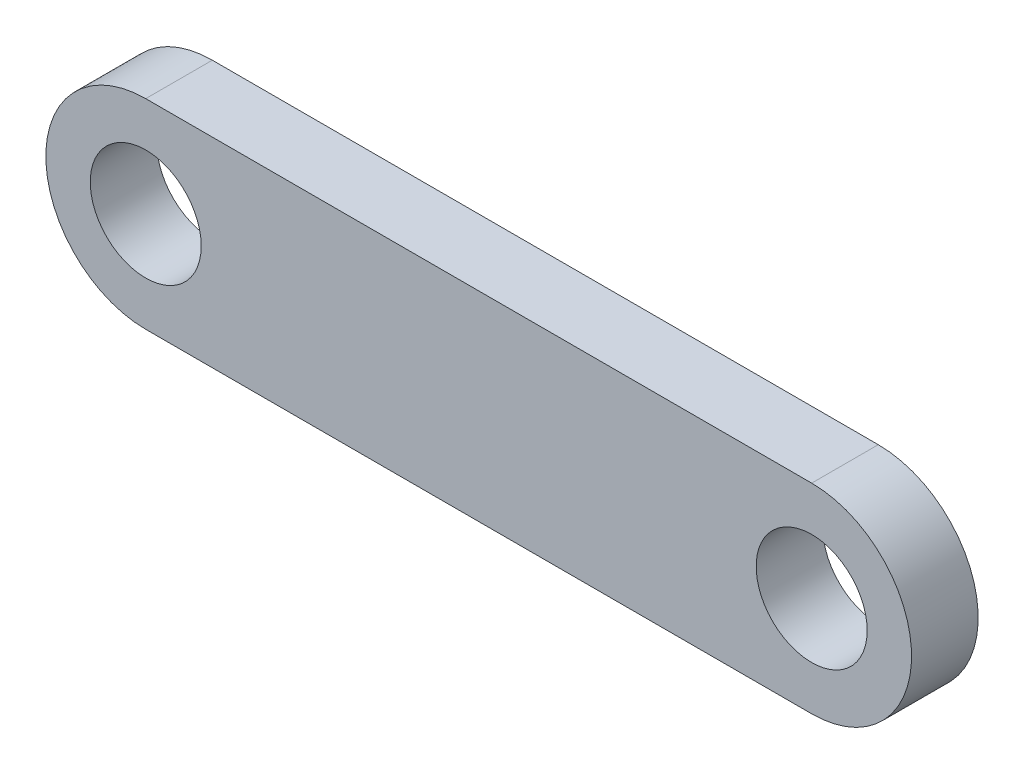
ISO-10303-21;
HEADER;
FILE_DESCRIPTION(('STEP AP214'),'2;1');
FILE_NAME('part.step','',(''),(''),'','','');
FILE_SCHEMA(('AUTOMOTIVE_DESIGN { 1 0 10303 214 1 1 1 1 }'));
ENDSEC;
DATA;
#1=APPLICATION_CONTEXT('core data for automotive mechanical design processes');
#2=APPLICATION_PROTOCOL_DEFINITION('international standard','automotive_design',2000,#1);
#3=PRODUCT_CONTEXT('',#1,'mechanical');
#4=PRODUCT('Part','Part','',(#3));
#5=PRODUCT_RELATED_PRODUCT_CATEGORY('part','',(#4));
#6=PRODUCT_DEFINITION_FORMATION('','',#4);
#7=PRODUCT_DEFINITION_CONTEXT('part definition',#1,'design');
#8=PRODUCT_DEFINITION('design','',#6,#7);
#9=PRODUCT_DEFINITION_SHAPE('','',#8);
#10=(LENGTH_UNIT() NAMED_UNIT(*) SI_UNIT(.MILLI.,.METRE.));
#11=(NAMED_UNIT(*) PLANE_ANGLE_UNIT() SI_UNIT($,.RADIAN.));
#12=(NAMED_UNIT(*) SI_UNIT($,.STERADIAN.) SOLID_ANGLE_UNIT());
#13=UNCERTAINTY_MEASURE_WITH_UNIT(LENGTH_MEASURE(1.E-05),#10,'distance_accuracy_value','');
#14=(GEOMETRIC_REPRESENTATION_CONTEXT(3) GLOBAL_UNCERTAINTY_ASSIGNED_CONTEXT((#13)) GLOBAL_UNIT_ASSIGNED_CONTEXT((#10,
#11,#12)) REPRESENTATION_CONTEXT('',''));
#15=CARTESIAN_POINT('',(0.,0.,0.));
#16=DIRECTION('',(0.,0.,1.));
#17=DIRECTION('',(1.,0.,0.));
#18=AXIS2_PLACEMENT_3D('',#15,#16,#17);
#19=CARTESIAN_POINT('',(-22.6794574039721,0.,6.));
#20=DIRECTION('',(0.,0.,1.));
#21=DIRECTION('',(1.,0.,0.));
#22=AXIS2_PLACEMENT_3D('',#19,#20,#21);
#23=PLANE('',#22);
#24=CARTESIAN_POINT('',(-22.6794574039721,0.,6.));
#25=DIRECTION('',(0.,0.,1.));
#26=DIRECTION('',(1.,0.,0.));
#27=AXIS2_PLACEMENT_3D('',#24,#25,#26);
#28=CIRCLE('',#27,5.);
#29=CARTESIAN_POINT('',(-17.6794574039721,0.,6.));
#30=VERTEX_POINT('',#29);
#31=EDGE_CURVE('E100',#30,#30,#28,.T.);
#32=ORIENTED_EDGE('',*,*,#31,.F.);
#33=EDGE_LOOP('',(#32));
#34=FACE_BOUND('',#33,.T.);
#35=CARTESIAN_POINT('',(-22.6794574039721,0.,6.));
#36=DIRECTION('',(0.,0.,1.));
#37=DIRECTION('',(1.,0.,0.));
#38=AXIS2_PLACEMENT_3D('',#35,#36,#37);
#39=CIRCLE('',#38,9.);
#40=CARTESIAN_POINT('',(-22.6794574039721,9.,6.));
#41=VERTEX_POINT('',#40);
#42=CARTESIAN_POINT('',(-22.6794574039721,-9.,6.));
#43=VERTEX_POINT('',#42);
#44=EDGE_CURVE('E85',#41,#43,#39,.T.);
#45=ORIENTED_EDGE('',*,*,#44,.T.);
#46=DIRECTION('',(1.,0.,0.));
#47=VECTOR('',#46,1.);
#48=CARTESIAN_POINT('',(-22.6794574039721,-9.,6.));
#49=LINE('',#48,#47);
#50=CARTESIAN_POINT('',(37.3205425960279,-9.,6.));
#51=VERTEX_POINT('',#50);
#52=EDGE_CURVE('E80',#43,#51,#49,.T.);
#53=ORIENTED_EDGE('',*,*,#52,.T.);
#54=CARTESIAN_POINT('',(37.3205425960279,0.,6.));
#55=DIRECTION('',(0.,0.,1.));
#56=DIRECTION('',(1.,0.,0.));
#57=AXIS2_PLACEMENT_3D('',#54,#55,#56);
#58=CIRCLE('',#57,9.);
#59=CARTESIAN_POINT('',(37.3205425960279,9.,6.));
#60=VERTEX_POINT('',#59);
#61=EDGE_CURVE('E83',#51,#60,#58,.T.);
#62=ORIENTED_EDGE('',*,*,#61,.T.);
#63=DIRECTION('',(-1.,0.,0.));
#64=VECTOR('',#63,1.);
#65=CARTESIAN_POINT('',(-22.6794574039721,9.,6.));
#66=LINE('',#65,#64);
#67=EDGE_CURVE('E50',#60,#41,#66,.T.);
#68=ORIENTED_EDGE('',*,*,#67,.T.);
#69=EDGE_LOOP('',(#45,#53,#62,#68));
#70=FACE_BOUND('',#69,.T.);
#71=CARTESIAN_POINT('',(37.3205425960279,0.,6.));
#72=DIRECTION('',(0.,0.,1.));
#73=DIRECTION('',(1.,0.,0.));
#74=AXIS2_PLACEMENT_3D('',#71,#72,#73);
#75=CIRCLE('',#74,5.);
#76=CARTESIAN_POINT('',(42.3205425960279,0.,6.));
#77=VERTEX_POINT('',#76);
#78=EDGE_CURVE('E115',#77,#77,#75,.T.);
#79=ORIENTED_EDGE('',*,*,#78,.F.);
#80=EDGE_LOOP('',(#79));
#81=FACE_BOUND('',#80,.T.);
#82=ADVANCED_FACE('F33',(#34,#70,#81),#23,.T.);
#83=CARTESIAN_POINT('',(-22.6794574039721,0.,0.));
#84=DIRECTION('',(0.,0.,1.));
#85=DIRECTION('',(1.,0.,0.));
#86=AXIS2_PLACEMENT_3D('',#83,#84,#85);
#87=PLANE('',#86);
#88=CARTESIAN_POINT('',(-22.6794574039721,0.,0.));
#89=DIRECTION('',(0.,0.,1.));
#90=DIRECTION('',(1.,0.,0.));
#91=AXIS2_PLACEMENT_3D('',#88,#89,#90);
#92=CIRCLE('',#91,9.);
#93=CARTESIAN_POINT('',(-22.6794574039721,9.,0.));
#94=VERTEX_POINT('',#93);
#95=CARTESIAN_POINT('',(-22.6794574039721,-9.,0.));
#96=VERTEX_POINT('',#95);
#97=EDGE_CURVE('E97',#94,#96,#92,.T.);
#98=ORIENTED_EDGE('',*,*,#97,.F.);
#99=DIRECTION('',(-1.,0.,0.));
#100=VECTOR('',#99,1.);
#101=CARTESIAN_POINT('',(-22.6794574039721,9.,0.));
#102=LINE('',#101,#100);
#103=CARTESIAN_POINT('',(37.3205425960279,9.,0.));
#104=VERTEX_POINT('',#103);
#105=EDGE_CURVE('E73',#104,#94,#102,.T.);
#106=ORIENTED_EDGE('',*,*,#105,.F.);
#107=CARTESIAN_POINT('',(37.3205425960279,0.,0.));
#108=DIRECTION('',(0.,0.,1.));
#109=DIRECTION('',(1.,0.,0.));
#110=AXIS2_PLACEMENT_3D('',#107,#108,#109);
#111=CIRCLE('',#110,9.);
#112=CARTESIAN_POINT('',(37.3205425960279,-9.,0.));
#113=VERTEX_POINT('',#112);
#114=EDGE_CURVE('E67',#113,#104,#111,.T.);
#115=ORIENTED_EDGE('',*,*,#114,.F.);
#116=DIRECTION('',(1.,0.,0.));
#117=VECTOR('',#116,1.);
#118=CARTESIAN_POINT('',(-22.6794574039721,-9.,0.));
#119=LINE('',#118,#117);
#120=EDGE_CURVE('E89',#96,#113,#119,.T.);
#121=ORIENTED_EDGE('',*,*,#120,.F.);
#122=EDGE_LOOP('',(#98,#106,#115,#121));
#123=FACE_BOUND('',#122,.T.);
#124=CARTESIAN_POINT('',(-22.6794574039721,0.,0.));
#125=DIRECTION('',(0.,0.,1.));
#126=DIRECTION('',(1.,0.,0.));
#127=AXIS2_PLACEMENT_3D('',#124,#125,#126);
#128=CIRCLE('',#127,5.);
#129=CARTESIAN_POINT('',(-17.6794574039721,0.,0.));
#130=VERTEX_POINT('',#129);
#131=EDGE_CURVE('E112',#130,#130,#128,.T.);
#132=ORIENTED_EDGE('',*,*,#131,.T.);
#133=EDGE_LOOP('',(#132));
#134=FACE_BOUND('',#133,.T.);
#135=CARTESIAN_POINT('',(37.3205425960279,0.,0.));
#136=DIRECTION('',(0.,0.,1.));
#137=DIRECTION('',(1.,0.,0.));
#138=AXIS2_PLACEMENT_3D('',#135,#136,#137);
#139=CIRCLE('',#138,5.);
#140=CARTESIAN_POINT('',(42.3205425960279,0.,0.));
#141=VERTEX_POINT('',#140);
#142=EDGE_CURVE('E118',#141,#141,#139,.T.);
#143=ORIENTED_EDGE('',*,*,#142,.T.);
#144=EDGE_LOOP('',(#143));
#145=FACE_BOUND('',#144,.T.);
#146=ADVANCED_FACE('F108',(#123,#134,#145),#87,.F.);
#147=CARTESIAN_POINT('',(-22.6794574039721,0.,6.));
#148=DIRECTION('',(0.,0.,-1.));
#149=DIRECTION('',(-1.,0.,0.));
#150=AXIS2_PLACEMENT_3D('',#147,#148,#149);
#151=CYLINDRICAL_SURFACE('',#150,9.);
#152=ORIENTED_EDGE('',*,*,#97,.T.);
#153=DIRECTION('',(0.,0.,-1.));
#154=VECTOR('',#153,1.);
#155=CARTESIAN_POINT('',(-22.6794574039721,-9.,6.));
#156=LINE('',#155,#154);
#157=EDGE_CURVE('E11',#43,#96,#156,.T.);
#158=ORIENTED_EDGE('',*,*,#157,.F.);
#159=ORIENTED_EDGE('',*,*,#44,.F.);
#160=DIRECTION('',(0.,0.,-1.));
#161=VECTOR('',#160,1.);
#162=CARTESIAN_POINT('',(-22.6794574039721,9.,6.));
#163=LINE('',#162,#161);
#164=EDGE_CURVE('E93',#41,#94,#163,.T.);
#165=ORIENTED_EDGE('',*,*,#164,.T.);
#166=EDGE_LOOP('',(#152,#158,#159,#165));
#167=FACE_BOUND('',#166,.T.);
#168=ADVANCED_FACE('F35',(#167),#151,.T.);
#169=CARTESIAN_POINT('',(-22.6794574039721,-9.,6.));
#170=DIRECTION('',(0.,1.,0.));
#171=DIRECTION('',(0.,0.,1.));
#172=AXIS2_PLACEMENT_3D('',#169,#170,#171);
#173=PLANE('',#172);
#174=ORIENTED_EDGE('',*,*,#120,.T.);
#175=DIRECTION('',(0.,0.,-1.));
#176=VECTOR('',#175,1.);
#177=CARTESIAN_POINT('',(37.3205425960279,-9.,6.));
#178=LINE('',#177,#176);
#179=EDGE_CURVE('E42',#51,#113,#178,.T.);
#180=ORIENTED_EDGE('',*,*,#179,.F.);
#181=ORIENTED_EDGE('',*,*,#52,.F.);
#182=ORIENTED_EDGE('',*,*,#157,.T.);
#183=EDGE_LOOP('',(#174,#180,#181,#182));
#184=FACE_BOUND('',#183,.T.);
#185=ADVANCED_FACE('F88',(#184),#173,.F.);
#186=CARTESIAN_POINT('',(37.3205425960279,0.,6.));
#187=DIRECTION('',(0.,0.,-1.));
#188=DIRECTION('',(-1.,0.,0.));
#189=AXIS2_PLACEMENT_3D('',#186,#187,#188);
#190=CYLINDRICAL_SURFACE('',#189,9.);
#191=ORIENTED_EDGE('',*,*,#114,.T.);
#192=DIRECTION('',(0.,0.,-1.));
#193=VECTOR('',#192,1.);
#194=CARTESIAN_POINT('',(37.3205425960279,9.,6.));
#195=LINE('',#194,#193);
#196=EDGE_CURVE('E90',#60,#104,#195,.T.);
#197=ORIENTED_EDGE('',*,*,#196,.F.);
#198=ORIENTED_EDGE('',*,*,#61,.F.);
#199=ORIENTED_EDGE('',*,*,#179,.T.);
#200=EDGE_LOOP('',(#191,#197,#198,#199));
#201=FACE_BOUND('',#200,.T.);
#202=ADVANCED_FACE('F91',(#201),#190,.T.);
#203=CARTESIAN_POINT('',(-22.6794574039721,9.,6.));
#204=DIRECTION('',(0.,-1.,0.));
#205=DIRECTION('',(0.,0.,-1.));
#206=AXIS2_PLACEMENT_3D('',#203,#204,#205);
#207=PLANE('',#206);
#208=ORIENTED_EDGE('',*,*,#105,.T.);
#209=ORIENTED_EDGE('',*,*,#164,.F.);
#210=ORIENTED_EDGE('',*,*,#67,.F.);
#211=ORIENTED_EDGE('',*,*,#196,.T.);
#212=EDGE_LOOP('',(#208,#209,#210,#211));
#213=FACE_BOUND('',#212,.T.);
#214=ADVANCED_FACE('F105',(#213),#207,.F.);
#215=CARTESIAN_POINT('',(-22.6794574039721,0.,6.));
#216=DIRECTION('',(0.,0.,-1.));
#217=DIRECTION('',(-1.,0.,0.));
#218=AXIS2_PLACEMENT_3D('',#215,#216,#217);
#219=CYLINDRICAL_SURFACE('',#218,5.);
#220=ORIENTED_EDGE('',*,*,#31,.T.);
#221=EDGE_LOOP('',(#220));
#222=FACE_BOUND('',#221,.T.);
#223=ORIENTED_EDGE('',*,*,#131,.F.);
#224=EDGE_LOOP('',(#223));
#225=FACE_BOUND('',#224,.T.);
#226=ADVANCED_FACE('F135',(#222,#225),#219,.F.);
#227=CARTESIAN_POINT('',(37.3205425960279,0.,6.));
#228=DIRECTION('',(0.,0.,-1.));
#229=DIRECTION('',(-1.,0.,0.));
#230=AXIS2_PLACEMENT_3D('',#227,#228,#229);
#231=CYLINDRICAL_SURFACE('',#230,5.);
#232=ORIENTED_EDGE('',*,*,#78,.T.);
#233=EDGE_LOOP('',(#232));
#234=FACE_BOUND('',#233,.T.);
#235=ORIENTED_EDGE('',*,*,#142,.F.);
#236=EDGE_LOOP('',(#235));
#237=FACE_BOUND('',#236,.T.);
#238=ADVANCED_FACE('F124',(#234,#237),#231,.F.);
#239=CLOSED_SHELL('',(#82,#146,#168,#185,#202,#214,#226,#238));
#240=MANIFOLD_SOLID_BREP('B2',#239);
#241=ADVANCED_BREP_SHAPE_REPRESENTATION('',(#18,#240),#14);
#242=SHAPE_DEFINITION_REPRESENTATION(#9,#241);
ENDSEC;
END-ISO-10303-21;
